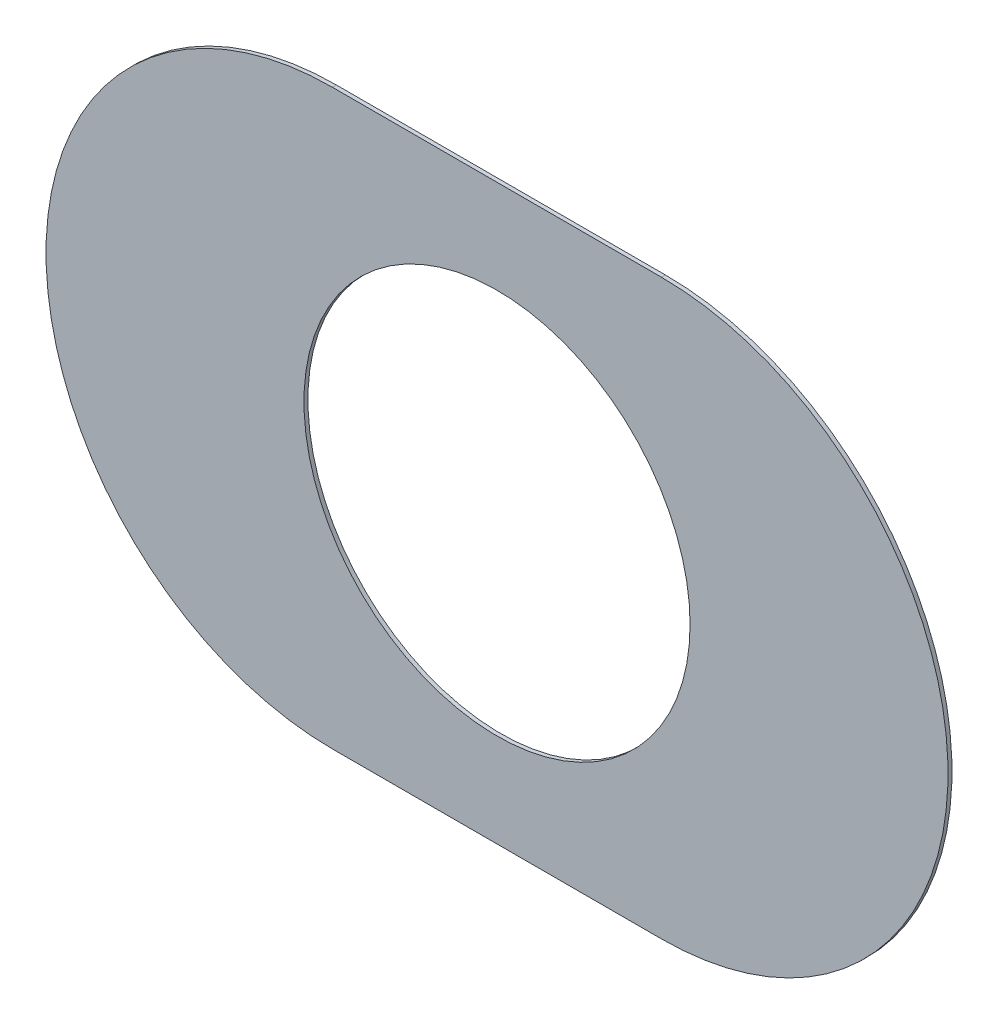
ISO-10303-21;
HEADER;
FILE_DESCRIPTION(('STEP AP214'),'2;1');
FILE_NAME('part.step','',(''),(''),'','','');
FILE_SCHEMA(('AUTOMOTIVE_DESIGN { 1 0 10303 214 1 1 1 1 }'));
ENDSEC;
DATA;
#1=APPLICATION_CONTEXT('core data for automotive mechanical design processes');
#2=APPLICATION_PROTOCOL_DEFINITION('international standard','automotive_design',2000,#1);
#3=PRODUCT_CONTEXT('',#1,'mechanical');
#4=PRODUCT('Part','Part','',(#3));
#5=PRODUCT_RELATED_PRODUCT_CATEGORY('part','',(#4));
#6=PRODUCT_DEFINITION_FORMATION('','',#4);
#7=PRODUCT_DEFINITION_CONTEXT('part definition',#1,'design');
#8=PRODUCT_DEFINITION('design','',#6,#7);
#9=PRODUCT_DEFINITION_SHAPE('','',#8);
#10=(LENGTH_UNIT() NAMED_UNIT(*) SI_UNIT(.MILLI.,.METRE.));
#11=(NAMED_UNIT(*) PLANE_ANGLE_UNIT() SI_UNIT($,.RADIAN.));
#12=(NAMED_UNIT(*) SI_UNIT($,.STERADIAN.) SOLID_ANGLE_UNIT());
#13=UNCERTAINTY_MEASURE_WITH_UNIT(LENGTH_MEASURE(1.E-05),#10,'distance_accuracy_value','');
#14=(GEOMETRIC_REPRESENTATION_CONTEXT(3) GLOBAL_UNCERTAINTY_ASSIGNED_CONTEXT((#13)) GLOBAL_UNIT_ASSIGNED_CONTEXT((#10,
#11,#12)) REPRESENTATION_CONTEXT('',''));
#15=CARTESIAN_POINT('',(0.,0.,0.));
#16=DIRECTION('',(0.,0.,1.));
#17=DIRECTION('',(1.,0.,0.));
#18=AXIS2_PLACEMENT_3D('',#15,#16,#17);
#19=CARTESIAN_POINT('',(24.3000003427268,12.0000006854535,0.));
#20=DIRECTION('',(0.,0.,1.));
#21=DIRECTION('',(1.,0.,0.));
#22=AXIS2_PLACEMENT_3D('',#19,#20,#21);
#23=PLANE('',#22);
#24=CARTESIAN_POINT('',(24.3000003427268,12.0000006854535,0.));
#25=DIRECTION('',(0.,0.,-1.));
#26=DIRECTION('',(-1.,0.,0.));
#27=AXIS2_PLACEMENT_3D('',#24,#25,#26);
#28=CIRCLE('',#27,0.49);
#29=CARTESIAN_POINT('',(24.7900003427268,12.0000006854535,0.));
#30=VERTEX_POINT('',#29);
#31=EDGE_CURVE('E63',#30,#30,#28,.T.);
#32=ORIENTED_EDGE('',*,*,#31,.T.);
#33=EDGE_LOOP('',(#32));
#34=FACE_BOUND('',#33,.T.);
#35=CARTESIAN_POINT('',(23.8825938881802,12.0000006854535,0.));
#36=DIRECTION('',(0.,0.,1.));
#37=DIRECTION('',(0.,1.,0.));
#38=AXIS2_PLACEMENT_3D('',#35,#36,#37);
#39=CIRCLE('',#38,0.727257121659981);
#40=CARTESIAN_POINT('',(23.8825938881802,12.7272578071135,0.));
#41=VERTEX_POINT('',#40);
#42=CARTESIAN_POINT('',(23.8825938881802,11.2727435637935,0.));
#43=VERTEX_POINT('',#42);
#44=EDGE_CURVE('E28',#41,#43,#39,.T.);
#45=ORIENTED_EDGE('',*,*,#44,.T.);
#46=DIRECTION('',(1.,0.,0.));
#47=VECTOR('',#46,1.);
#48=CARTESIAN_POINT('',(23.8825938881802,11.2727435637935,0.));
#49=LINE('',#48,#47);
#50=CARTESIAN_POINT('',(24.7174067972734,11.2727435637935,0.));
#51=VERTEX_POINT('',#50);
#52=EDGE_CURVE('E21',#43,#51,#49,.T.);
#53=ORIENTED_EDGE('',*,*,#52,.T.);
#54=CARTESIAN_POINT('',(24.7174067972734,12.0000006854535,0.));
#55=DIRECTION('',(0.,0.,1.));
#56=DIRECTION('',(0.,-1.,0.));
#57=AXIS2_PLACEMENT_3D('',#54,#55,#56);
#58=CIRCLE('',#57,0.727257121659981);
#59=CARTESIAN_POINT('',(24.7174067972734,12.7272578071135,0.));
#60=VERTEX_POINT('',#59);
#61=EDGE_CURVE('E106',#51,#60,#58,.T.);
#62=ORIENTED_EDGE('',*,*,#61,.T.);
#63=DIRECTION('',(-1.,0.,0.));
#64=VECTOR('',#63,1.);
#65=CARTESIAN_POINT('',(24.7174067972734,12.7272578071135,0.));
#66=LINE('',#65,#64);
#67=EDGE_CURVE('E117',#60,#41,#66,.T.);
#68=ORIENTED_EDGE('',*,*,#67,.T.);
#69=EDGE_LOOP('',(#45,#53,#62,#68));
#70=FACE_BOUND('',#69,.T.);
#71=ADVANCED_FACE('F17',(#34,#70),#23,.T.);
#72=CARTESIAN_POINT('',(24.3000003427268,12.0000006854535,-0.01));
#73=DIRECTION('',(0.,0.,1.));
#74=DIRECTION('',(1.,0.,0.));
#75=AXIS2_PLACEMENT_3D('',#72,#73,#74);
#76=PLANE('',#75);
#77=CARTESIAN_POINT('',(24.3000003427268,12.0000006854535,-0.01));
#78=DIRECTION('',(0.,0.,-1.));
#79=DIRECTION('',(-1.,0.,0.));
#80=AXIS2_PLACEMENT_3D('',#77,#78,#79);
#81=CIRCLE('',#80,0.49);
#82=CARTESIAN_POINT('',(24.7900003427268,12.0000006854535,-0.01));
#83=VERTEX_POINT('',#82);
#84=EDGE_CURVE('E120',#83,#83,#81,.T.);
#85=ORIENTED_EDGE('',*,*,#84,.F.);
#86=EDGE_LOOP('',(#85));
#87=FACE_BOUND('',#86,.T.);
#88=CARTESIAN_POINT('',(23.8825938881802,12.0000006854535,-0.01));
#89=DIRECTION('',(0.,0.,1.));
#90=DIRECTION('',(0.,1.,0.));
#91=AXIS2_PLACEMENT_3D('',#88,#89,#90);
#92=CIRCLE('',#91,0.727257121659981);
#93=CARTESIAN_POINT('',(23.8825938881802,12.7272578071135,-0.01));
#94=VERTEX_POINT('',#93);
#95=CARTESIAN_POINT('',(23.8825938881802,11.2727435637935,-0.01));
#96=VERTEX_POINT('',#95);
#97=EDGE_CURVE('E11',#94,#96,#92,.T.);
#98=ORIENTED_EDGE('',*,*,#97,.F.);
#99=DIRECTION('',(-1.,0.,0.));
#100=VECTOR('',#99,1.);
#101=CARTESIAN_POINT('',(24.7174067972734,12.7272578071135,-0.01));
#102=LINE('',#101,#100);
#103=CARTESIAN_POINT('',(24.7174067972734,12.7272578071135,-0.01));
#104=VERTEX_POINT('',#103);
#105=EDGE_CURVE('E100',#104,#94,#102,.T.);
#106=ORIENTED_EDGE('',*,*,#105,.F.);
#107=CARTESIAN_POINT('',(24.7174067972734,12.0000006854535,-0.01));
#108=DIRECTION('',(0.,0.,1.));
#109=DIRECTION('',(0.,-1.,0.));
#110=AXIS2_PLACEMENT_3D('',#107,#108,#109);
#111=CIRCLE('',#110,0.727257121659981);
#112=CARTESIAN_POINT('',(24.7174067972734,11.2727435637935,-0.01));
#113=VERTEX_POINT('',#112);
#114=EDGE_CURVE('E97',#113,#104,#111,.T.);
#115=ORIENTED_EDGE('',*,*,#114,.F.);
#116=DIRECTION('',(1.,0.,0.));
#117=VECTOR('',#116,1.);
#118=CARTESIAN_POINT('',(23.8825938881802,11.2727435637935,-0.01));
#119=LINE('',#118,#117);
#120=EDGE_CURVE('E85',#96,#113,#119,.T.);
#121=ORIENTED_EDGE('',*,*,#120,.F.);
#122=EDGE_LOOP('',(#98,#106,#115,#121));
#123=FACE_BOUND('',#122,.T.);
#124=ADVANCED_FACE('F98',(#87,#123),#76,.F.);
#125=CARTESIAN_POINT('',(23.8825938881802,12.0000006854535,0.));
#126=DIRECTION('',(0.,0.,1.));
#127=DIRECTION('',(0.,1.,0.));
#128=AXIS2_PLACEMENT_3D('',#125,#126,#127);
#129=CYLINDRICAL_SURFACE('',#128,0.727257121659981);
#130=ORIENTED_EDGE('',*,*,#44,.F.);
#131=DIRECTION('',(0.,0.,-1.));
#132=VECTOR('',#131,1.);
#133=CARTESIAN_POINT('',(23.8825938881802,12.7272578071135,0.));
#134=LINE('',#133,#132);
#135=EDGE_CURVE('E113',#41,#94,#134,.T.);
#136=ORIENTED_EDGE('',*,*,#135,.T.);
#137=ORIENTED_EDGE('',*,*,#97,.T.);
#138=DIRECTION('',(0.,0.,-1.));
#139=VECTOR('',#138,1.);
#140=CARTESIAN_POINT('',(23.8825938881802,11.2727435637935,0.));
#141=LINE('',#140,#139);
#142=EDGE_CURVE('E92',#43,#96,#141,.T.);
#143=ORIENTED_EDGE('',*,*,#142,.F.);
#144=EDGE_LOOP('',(#130,#136,#137,#143));
#145=FACE_BOUND('',#144,.T.);
#146=ADVANCED_FACE('F137',(#145),#129,.T.);
#147=CARTESIAN_POINT('',(23.8825938881802,11.2727435637935,0.));
#148=DIRECTION('',(0.,1.,0.));
#149=DIRECTION('',(1.,0.,0.));
#150=AXIS2_PLACEMENT_3D('',#147,#148,#149);
#151=PLANE('',#150);
#152=ORIENTED_EDGE('',*,*,#52,.F.);
#153=ORIENTED_EDGE('',*,*,#142,.T.);
#154=ORIENTED_EDGE('',*,*,#120,.T.);
#155=DIRECTION('',(0.,0.,-1.));
#156=VECTOR('',#155,1.);
#157=CARTESIAN_POINT('',(24.7174067972734,11.2727435637935,0.));
#158=LINE('',#157,#156);
#159=EDGE_CURVE('E90',#51,#113,#158,.T.);
#160=ORIENTED_EDGE('',*,*,#159,.F.);
#161=EDGE_LOOP('',(#152,#153,#154,#160));
#162=FACE_BOUND('',#161,.T.);
#163=ADVANCED_FACE('F88',(#162),#151,.F.);
#164=CARTESIAN_POINT('',(24.7174067972734,12.0000006854535,0.));
#165=DIRECTION('',(0.,0.,1.));
#166=DIRECTION('',(0.,-1.,0.));
#167=AXIS2_PLACEMENT_3D('',#164,#165,#166);
#168=CYLINDRICAL_SURFACE('',#167,0.727257121659981);
#169=ORIENTED_EDGE('',*,*,#61,.F.);
#170=ORIENTED_EDGE('',*,*,#159,.T.);
#171=ORIENTED_EDGE('',*,*,#114,.T.);
#172=DIRECTION('',(0.,0.,-1.));
#173=VECTOR('',#172,1.);
#174=CARTESIAN_POINT('',(24.7174067972734,12.7272578071135,0.));
#175=LINE('',#174,#173);
#176=EDGE_CURVE('E118',#60,#104,#175,.T.);
#177=ORIENTED_EDGE('',*,*,#176,.F.);
#178=EDGE_LOOP('',(#169,#170,#171,#177));
#179=FACE_BOUND('',#178,.T.);
#180=ADVANCED_FACE('F19',(#179),#168,.T.);
#181=CARTESIAN_POINT('',(24.7174067972734,12.7272578071135,0.));
#182=DIRECTION('',(0.,-1.,0.));
#183=DIRECTION('',(0.,0.,-1.));
#184=AXIS2_PLACEMENT_3D('',#181,#182,#183);
#185=PLANE('',#184);
#186=ORIENTED_EDGE('',*,*,#67,.F.);
#187=ORIENTED_EDGE('',*,*,#176,.T.);
#188=ORIENTED_EDGE('',*,*,#105,.T.);
#189=ORIENTED_EDGE('',*,*,#135,.F.);
#190=EDGE_LOOP('',(#186,#187,#188,#189));
#191=FACE_BOUND('',#190,.T.);
#192=ADVANCED_FACE('F154',(#191),#185,.F.);
#193=CARTESIAN_POINT('',(24.3000003427268,12.0000006854535,0.));
#194=DIRECTION('',(0.,0.,1.));
#195=DIRECTION('',(-1.,0.,0.));
#196=AXIS2_PLACEMENT_3D('',#193,#194,#195);
#197=CYLINDRICAL_SURFACE('',#196,0.49);
#198=ORIENTED_EDGE('',*,*,#84,.T.);
#199=DIRECTION('',(0.,0.,1.));
#200=VECTOR('',#199,1.);
#201=CARTESIAN_POINT('',(24.7900003427268,12.0000006854535,0.));
#202=LINE('',#201,#200);
#203=EDGE_CURVE('E55',#83,#30,#202,.T.);
#204=ORIENTED_EDGE('',*,*,#203,.T.);
#205=ORIENTED_EDGE('',*,*,#31,.F.);
#206=ORIENTED_EDGE('',*,*,#203,.F.);
#207=EDGE_LOOP('',(#198,#204,#205,#206));
#208=FACE_BOUND('',#207,.T.);
#209=ADVANCED_FACE('F152',(#208),#197,.F.);
#210=CLOSED_SHELL('',(#71,#124,#146,#163,#180,#192,#209));
#211=MANIFOLD_SOLID_BREP('B1',#210);
#212=ADVANCED_BREP_SHAPE_REPRESENTATION('',(#18,#211),#14);
#213=SHAPE_DEFINITION_REPRESENTATION(#9,#212);
ENDSEC;
END-ISO-10303-21;
